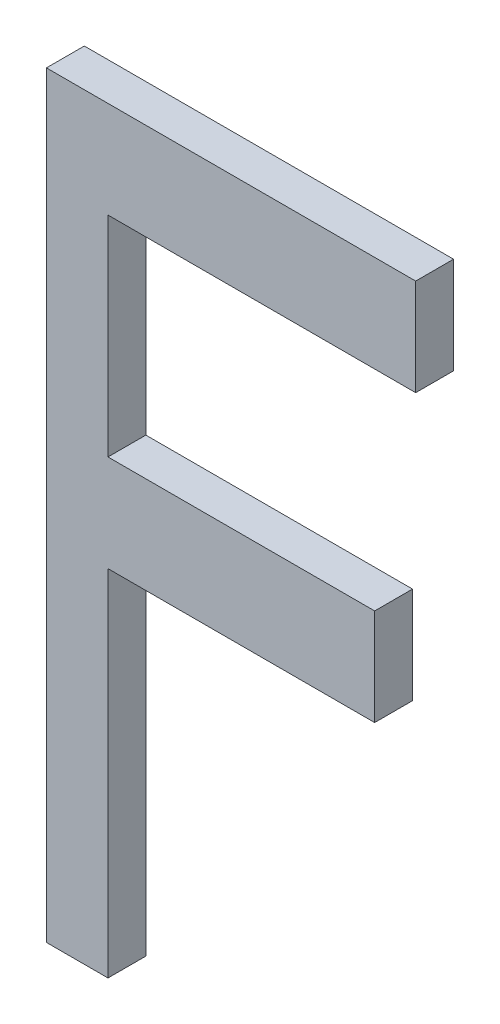
ISO-10303-21;
HEADER;
FILE_DESCRIPTION(('STEP AP214'),'2;1');
FILE_NAME('part.step','',(''),(''),'','','');
FILE_SCHEMA(('AUTOMOTIVE_DESIGN { 1 0 10303 214 1 1 1 1 }'));
ENDSEC;
DATA;
#1=APPLICATION_CONTEXT('core data for automotive mechanical design processes');
#2=APPLICATION_PROTOCOL_DEFINITION('international standard','automotive_design',2000,#1);
#3=PRODUCT_CONTEXT('',#1,'mechanical');
#4=PRODUCT('Part','Part','',(#3));
#5=PRODUCT_RELATED_PRODUCT_CATEGORY('part','',(#4));
#6=PRODUCT_DEFINITION_FORMATION('','',#4);
#7=PRODUCT_DEFINITION_CONTEXT('part definition',#1,'design');
#8=PRODUCT_DEFINITION('design','',#6,#7);
#9=PRODUCT_DEFINITION_SHAPE('','',#8);
#10=(LENGTH_UNIT() NAMED_UNIT(*) SI_UNIT(.MILLI.,.METRE.));
#11=(NAMED_UNIT(*) PLANE_ANGLE_UNIT() SI_UNIT($,.RADIAN.));
#12=(NAMED_UNIT(*) SI_UNIT($,.STERADIAN.) SOLID_ANGLE_UNIT());
#13=UNCERTAINTY_MEASURE_WITH_UNIT(LENGTH_MEASURE(1.E-05),#10,'distance_accuracy_value','');
#14=(GEOMETRIC_REPRESENTATION_CONTEXT(3) GLOBAL_UNCERTAINTY_ASSIGNED_CONTEXT((#13)) GLOBAL_UNIT_ASSIGNED_CONTEXT((#10,
#11,#12)) REPRESENTATION_CONTEXT('',''));
#15=CARTESIAN_POINT('',(0.,0.,0.));
#16=DIRECTION('',(0.,0.,1.));
#17=DIRECTION('',(1.,0.,0.));
#18=AXIS2_PLACEMENT_3D('',#15,#16,#17);
#19=CARTESIAN_POINT('',(32.6648311134674,28.2906710184784,5.9));
#20=DIRECTION('',(0.,0.,1.));
#21=DIRECTION('',(1.,0.,0.));
#22=AXIS2_PLACEMENT_3D('',#19,#20,#21);
#23=PLANE('',#22);
#24=DIRECTION('',(1.,0.,0.));
#25=VECTOR('',#24,1.);
#26=CARTESIAN_POINT('',(32.6648311134674,30.2906710184784,5.9));
#27=LINE('',#26,#25);
#28=CARTESIAN_POINT('',(33.6398311134674,30.2906710184784,5.9));
#29=VERTEX_POINT('',#28);
#30=CARTESIAN_POINT('',(32.6648311134674,30.2906710184784,5.9));
#31=VERTEX_POINT('',#30);
#32=EDGE_CURVE('E126',#29,#31,#27,.F.);
#33=ORIENTED_EDGE('',*,*,#32,.F.);
#34=DIRECTION('',(0.,1.,0.));
#35=VECTOR('',#34,1.);
#36=CARTESIAN_POINT('',(33.6398311134674,28.2906710184784,5.9));
#37=LINE('',#36,#35);
#38=CARTESIAN_POINT('',(33.6398311134674,30.0353518999784,5.9));
#39=VERTEX_POINT('',#38);
#40=EDGE_CURVE('E124',#39,#29,#37,.T.);
#41=ORIENTED_EDGE('',*,*,#40,.F.);
#42=DIRECTION('',(1.,0.,0.));
#43=VECTOR('',#42,1.);
#44=CARTESIAN_POINT('',(32.6648311134674,30.0353518999784,5.9));
#45=LINE('',#44,#43);
#46=CARTESIAN_POINT('',(32.8273311134674,30.0353518999784,5.9));
#47=VERTEX_POINT('',#46);
#48=EDGE_CURVE('E122',#47,#39,#45,.T.);
#49=ORIENTED_EDGE('',*,*,#48,.F.);
#50=DIRECTION('',(0.,1.,0.));
#51=VECTOR('',#50,1.);
#52=CARTESIAN_POINT('',(32.8273311134674,28.2906710184784,5.9));
#53=LINE('',#52,#51);
#54=CARTESIAN_POINT('',(32.8273311134674,29.4821603573584,5.9));
#55=VERTEX_POINT('',#54);
#56=EDGE_CURVE('E120',#55,#47,#53,.T.);
#57=ORIENTED_EDGE('',*,*,#56,.F.);
#58=DIRECTION('',(1.,0.,0.));
#59=VECTOR('',#58,1.);
#60=CARTESIAN_POINT('',(32.6648311134674,29.4821603573585,5.9));
#61=LINE('',#60,#59);
#62=CARTESIAN_POINT('',(33.5314978059574,29.4821603573585,5.9));
#63=VERTEX_POINT('',#62);
#64=EDGE_CURVE('E118',#63,#55,#61,.F.);
#65=ORIENTED_EDGE('',*,*,#64,.F.);
#66=DIRECTION('',(0.,1.,0.));
#67=VECTOR('',#66,1.);
#68=CARTESIAN_POINT('',(33.5314978059574,28.2906710184784,5.9));
#69=LINE('',#68,#67);
#70=CARTESIAN_POINT('',(33.5314978059574,29.2268412388584,5.9));
#71=VERTEX_POINT('',#70);
#72=EDGE_CURVE('E114',#71,#63,#69,.T.);
#73=ORIENTED_EDGE('',*,*,#72,.F.);
#74=DIRECTION('',(1.,0.,0.));
#75=VECTOR('',#74,1.);
#76=CARTESIAN_POINT('',(32.6648311134674,29.2268412388584,5.9));
#77=LINE('',#76,#75);
#78=CARTESIAN_POINT('',(32.8273311134674,29.2268412388584,5.9));
#79=VERTEX_POINT('',#78);
#80=EDGE_CURVE('E113',#79,#71,#77,.T.);
#81=ORIENTED_EDGE('',*,*,#80,.F.);
#82=DIRECTION('',(0.,1.,0.));
#83=VECTOR('',#82,1.);
#84=CARTESIAN_POINT('',(32.8273311134674,28.2906710184784,5.9));
#85=LINE('',#84,#83);
#86=CARTESIAN_POINT('',(32.8273311134674,28.2906710184784,5.9));
#87=VERTEX_POINT('',#86);
#88=EDGE_CURVE('E91',#87,#79,#85,.T.);
#89=ORIENTED_EDGE('',*,*,#88,.F.);
#90=DIRECTION('',(1.,0.,0.));
#91=VECTOR('',#90,1.);
#92=CARTESIAN_POINT('',(32.6648311134674,28.2906710184784,5.9));
#93=LINE('',#92,#91);
#94=CARTESIAN_POINT('',(32.6648311134674,28.2906710184784,5.9));
#95=VERTEX_POINT('',#94);
#96=EDGE_CURVE('E20',#95,#87,#93,.T.);
#97=ORIENTED_EDGE('',*,*,#96,.F.);
#98=DIRECTION('',(0.,1.,0.));
#99=VECTOR('',#98,1.);
#100=CARTESIAN_POINT('',(32.6648311134674,30.2906710184784,5.9));
#101=LINE('',#100,#99);
#102=EDGE_CURVE('E128',#95,#31,#101,.T.);
#103=ORIENTED_EDGE('',*,*,#102,.T.);
#104=EDGE_LOOP('',(#33,#41,#49,#57,#65,#73,#81,#89,#97,#103));
#105=FACE_BOUND('',#104,.T.);
#106=ADVANCED_FACE('F17',(#105),#23,.F.);
#107=CARTESIAN_POINT('',(32.6648311134674,30.2906710184784,6.));
#108=DIRECTION('',(1.,0.,0.));
#109=DIRECTION('',(0.,0.,-1.));
#110=AXIS2_PLACEMENT_3D('',#107,#108,#109);
#111=PLANE('',#110);
#112=DIRECTION('',(0.,0.,1.));
#113=VECTOR('',#112,1.);
#114=CARTESIAN_POINT('',(32.6648311134674,28.2906710184784,6.));
#115=LINE('',#114,#113);
#116=CARTESIAN_POINT('',(32.6648311134674,28.2906710184784,6.));
#117=VERTEX_POINT('',#116);
#118=EDGE_CURVE('E100',#95,#117,#115,.T.);
#119=ORIENTED_EDGE('',*,*,#118,.T.);
#120=DIRECTION('',(0.,1.,0.));
#121=VECTOR('',#120,1.);
#122=CARTESIAN_POINT('',(32.6648311134674,28.2906710184784,6.));
#123=LINE('',#122,#121);
#124=CARTESIAN_POINT('',(32.6648311134674,30.2906710184784,6.));
#125=VERTEX_POINT('',#124);
#126=EDGE_CURVE('E146',#125,#117,#123,.F.);
#127=ORIENTED_EDGE('',*,*,#126,.F.);
#128=DIRECTION('',(0.,0.,-1.));
#129=VECTOR('',#128,1.);
#130=CARTESIAN_POINT('',(32.6648311134674,30.2906710184784,6.));
#131=LINE('',#130,#129);
#132=EDGE_CURVE('E143',#125,#31,#131,.T.);
#133=ORIENTED_EDGE('',*,*,#132,.T.);
#134=ORIENTED_EDGE('',*,*,#102,.F.);
#135=EDGE_LOOP('',(#119,#127,#133,#134));
#136=FACE_BOUND('',#135,.T.);
#137=ADVANCED_FACE('F181',(#136),#111,.F.);
#138=CARTESIAN_POINT('',(32.6648311134674,28.2906710184784,6.));
#139=DIRECTION('',(0.,1.,0.));
#140=DIRECTION('',(0.,0.,1.));
#141=AXIS2_PLACEMENT_3D('',#138,#139,#140);
#142=PLANE('',#141);
#143=DIRECTION('',(0.,0.,1.));
#144=VECTOR('',#143,1.);
#145=CARTESIAN_POINT('',(32.8273311134674,28.2906710184784,6.));
#146=LINE('',#145,#144);
#147=CARTESIAN_POINT('',(32.8273311134674,28.2906710184784,6.));
#148=VERTEX_POINT('',#147);
#149=EDGE_CURVE('E98',#87,#148,#146,.T.);
#150=ORIENTED_EDGE('',*,*,#149,.T.);
#151=DIRECTION('',(1.,0.,0.));
#152=VECTOR('',#151,1.);
#153=CARTESIAN_POINT('',(32.6648311134674,28.2906710184784,6.));
#154=LINE('',#153,#152);
#155=EDGE_CURVE('E149',#117,#148,#154,.T.);
#156=ORIENTED_EDGE('',*,*,#155,.F.);
#157=ORIENTED_EDGE('',*,*,#118,.F.);
#158=ORIENTED_EDGE('',*,*,#96,.T.);
#159=EDGE_LOOP('',(#150,#156,#157,#158));
#160=FACE_BOUND('',#159,.T.);
#161=ADVANCED_FACE('F96',(#160),#142,.F.);
#162=CARTESIAN_POINT('',(32.8273311134674,28.2906710184784,6.));
#163=DIRECTION('',(-1.,0.,0.));
#164=DIRECTION('',(0.,0.,1.));
#165=AXIS2_PLACEMENT_3D('',#162,#163,#164);
#166=PLANE('',#165);
#167=DIRECTION('',(0.,0.,1.));
#168=VECTOR('',#167,1.);
#169=CARTESIAN_POINT('',(32.8273311134674,29.2268412388584,6.));
#170=LINE('',#169,#168);
#171=CARTESIAN_POINT('',(32.8273311134674,29.2268412388584,6.));
#172=VERTEX_POINT('',#171);
#173=EDGE_CURVE('E108',#79,#172,#170,.T.);
#174=ORIENTED_EDGE('',*,*,#173,.T.);
#175=DIRECTION('',(0.,1.,0.));
#176=VECTOR('',#175,1.);
#177=CARTESIAN_POINT('',(32.8273311134674,28.2906710184784,6.));
#178=LINE('',#177,#176);
#179=EDGE_CURVE('E106',#148,#172,#178,.T.);
#180=ORIENTED_EDGE('',*,*,#179,.F.);
#181=ORIENTED_EDGE('',*,*,#149,.F.);
#182=ORIENTED_EDGE('',*,*,#88,.T.);
#183=EDGE_LOOP('',(#174,#180,#181,#182));
#184=FACE_BOUND('',#183,.T.);
#185=ADVANCED_FACE('F104',(#184),#166,.F.);
#186=CARTESIAN_POINT('',(32.8273311134674,29.2268412388584,6.));
#187=DIRECTION('',(0.,1.,0.));
#188=DIRECTION('',(0.,0.,1.));
#189=AXIS2_PLACEMENT_3D('',#186,#187,#188);
#190=PLANE('',#189);
#191=DIRECTION('',(0.,0.,1.));
#192=VECTOR('',#191,1.);
#193=CARTESIAN_POINT('',(33.5314978059574,29.2268412388584,6.));
#194=LINE('',#193,#192);
#195=CARTESIAN_POINT('',(33.5314978059574,29.2268412388584,6.));
#196=VERTEX_POINT('',#195);
#197=EDGE_CURVE('E132',#71,#196,#194,.T.);
#198=ORIENTED_EDGE('',*,*,#197,.T.);
#199=DIRECTION('',(1.,0.,0.));
#200=VECTOR('',#199,1.);
#201=CARTESIAN_POINT('',(32.6648311134674,29.2268412388584,6.));
#202=LINE('',#201,#200);
#203=EDGE_CURVE('E152',#172,#196,#202,.T.);
#204=ORIENTED_EDGE('',*,*,#203,.F.);
#205=ORIENTED_EDGE('',*,*,#173,.F.);
#206=ORIENTED_EDGE('',*,*,#80,.T.);
#207=EDGE_LOOP('',(#198,#204,#205,#206));
#208=FACE_BOUND('',#207,.T.);
#209=ADVANCED_FACE('F185',(#208),#190,.F.);
#210=CARTESIAN_POINT('',(33.5314978059574,29.2268412388584,6.));
#211=DIRECTION('',(-1.,0.,0.));
#212=DIRECTION('',(0.,0.,1.));
#213=AXIS2_PLACEMENT_3D('',#210,#211,#212);
#214=PLANE('',#213);
#215=DIRECTION('',(0.,0.,-1.));
#216=VECTOR('',#215,1.);
#217=CARTESIAN_POINT('',(33.5314978059574,29.4821603573584,6.));
#218=LINE('',#217,#216);
#219=CARTESIAN_POINT('',(33.5314978059574,29.4821603573585,6.));
#220=VERTEX_POINT('',#219);
#221=EDGE_CURVE('E134',#63,#220,#218,.F.);
#222=ORIENTED_EDGE('',*,*,#221,.T.);
#223=DIRECTION('',(0.,1.,0.));
#224=VECTOR('',#223,1.);
#225=CARTESIAN_POINT('',(33.5314978059574,28.2906710184784,6.));
#226=LINE('',#225,#224);
#227=EDGE_CURVE('E155',#196,#220,#226,.T.);
#228=ORIENTED_EDGE('',*,*,#227,.F.);
#229=ORIENTED_EDGE('',*,*,#197,.F.);
#230=ORIENTED_EDGE('',*,*,#72,.T.);
#231=EDGE_LOOP('',(#222,#228,#229,#230));
#232=FACE_BOUND('',#231,.T.);
#233=ADVANCED_FACE('F188',(#232),#214,.F.);
#234=CARTESIAN_POINT('',(33.5314978059574,29.4821603573584,6.));
#235=DIRECTION('',(0.,-1.,0.));
#236=DIRECTION('',(0.,0.,-1.));
#237=AXIS2_PLACEMENT_3D('',#234,#235,#236);
#238=PLANE('',#237);
#239=DIRECTION('',(0.,0.,1.));
#240=VECTOR('',#239,1.);
#241=CARTESIAN_POINT('',(32.8273311134674,29.4821603573584,6.));
#242=LINE('',#241,#240);
#243=CARTESIAN_POINT('',(32.8273311134674,29.4821603573584,6.));
#244=VERTEX_POINT('',#243);
#245=EDGE_CURVE('E136',#55,#244,#242,.T.);
#246=ORIENTED_EDGE('',*,*,#245,.T.);
#247=DIRECTION('',(1.,0.,0.));
#248=VECTOR('',#247,1.);
#249=CARTESIAN_POINT('',(32.6648311134674,29.4821603573585,6.));
#250=LINE('',#249,#248);
#251=EDGE_CURVE('E158',#220,#244,#250,.F.);
#252=ORIENTED_EDGE('',*,*,#251,.F.);
#253=ORIENTED_EDGE('',*,*,#221,.F.);
#254=ORIENTED_EDGE('',*,*,#64,.T.);
#255=EDGE_LOOP('',(#246,#252,#253,#254));
#256=FACE_BOUND('',#255,.T.);
#257=ADVANCED_FACE('F193',(#256),#238,.F.);
#258=CARTESIAN_POINT('',(32.8273311134674,29.4821603573584,6.));
#259=DIRECTION('',(-1.,0.,0.));
#260=DIRECTION('',(0.,0.,1.));
#261=AXIS2_PLACEMENT_3D('',#258,#259,#260);
#262=PLANE('',#261);
#263=DIRECTION('',(0.,0.,1.));
#264=VECTOR('',#263,1.);
#265=CARTESIAN_POINT('',(32.8273311134674,30.0353518999784,6.));
#266=LINE('',#265,#264);
#267=CARTESIAN_POINT('',(32.8273311134674,30.0353518999784,6.));
#268=VERTEX_POINT('',#267);
#269=EDGE_CURVE('E138',#47,#268,#266,.T.);
#270=ORIENTED_EDGE('',*,*,#269,.T.);
#271=DIRECTION('',(0.,1.,0.));
#272=VECTOR('',#271,1.);
#273=CARTESIAN_POINT('',(32.8273311134674,28.2906710184784,6.));
#274=LINE('',#273,#272);
#275=EDGE_CURVE('E161',#244,#268,#274,.T.);
#276=ORIENTED_EDGE('',*,*,#275,.F.);
#277=ORIENTED_EDGE('',*,*,#245,.F.);
#278=ORIENTED_EDGE('',*,*,#56,.T.);
#279=EDGE_LOOP('',(#270,#276,#277,#278));
#280=FACE_BOUND('',#279,.T.);
#281=ADVANCED_FACE('F197',(#280),#262,.F.);
#282=CARTESIAN_POINT('',(32.8273311134674,30.0353518999784,6.));
#283=DIRECTION('',(0.,1.,0.));
#284=DIRECTION('',(0.,0.,1.));
#285=AXIS2_PLACEMENT_3D('',#282,#283,#284);
#286=PLANE('',#285);
#287=DIRECTION('',(0.,0.,1.));
#288=VECTOR('',#287,1.);
#289=CARTESIAN_POINT('',(33.6398311134674,30.0353518999784,6.));
#290=LINE('',#289,#288);
#291=CARTESIAN_POINT('',(33.6398311134674,30.0353518999784,6.));
#292=VERTEX_POINT('',#291);
#293=EDGE_CURVE('E140',#39,#292,#290,.T.);
#294=ORIENTED_EDGE('',*,*,#293,.T.);
#295=DIRECTION('',(1.,0.,0.));
#296=VECTOR('',#295,1.);
#297=CARTESIAN_POINT('',(32.6648311134674,30.0353518999784,6.));
#298=LINE('',#297,#296);
#299=EDGE_CURVE('E164',#268,#292,#298,.T.);
#300=ORIENTED_EDGE('',*,*,#299,.F.);
#301=ORIENTED_EDGE('',*,*,#269,.F.);
#302=ORIENTED_EDGE('',*,*,#48,.T.);
#303=EDGE_LOOP('',(#294,#300,#301,#302));
#304=FACE_BOUND('',#303,.T.);
#305=ADVANCED_FACE('F199',(#304),#286,.F.);
#306=CARTESIAN_POINT('',(33.6398311134674,30.0353518999784,6.));
#307=DIRECTION('',(-1.,0.,0.));
#308=DIRECTION('',(0.,0.,1.));
#309=AXIS2_PLACEMENT_3D('',#306,#307,#308);
#310=PLANE('',#309);
#311=DIRECTION('',(0.,0.,-1.));
#312=VECTOR('',#311,1.);
#313=CARTESIAN_POINT('',(33.6398311134674,30.2906710184784,6.));
#314=LINE('',#313,#312);
#315=CARTESIAN_POINT('',(33.6398311134674,30.2906710184784,6.));
#316=VERTEX_POINT('',#315);
#317=EDGE_CURVE('E35',#29,#316,#314,.F.);
#318=ORIENTED_EDGE('',*,*,#317,.T.);
#319=DIRECTION('',(0.,1.,0.));
#320=VECTOR('',#319,1.);
#321=CARTESIAN_POINT('',(33.6398311134674,28.2906710184784,6.));
#322=LINE('',#321,#320);
#323=EDGE_CURVE('E26',#292,#316,#322,.T.);
#324=ORIENTED_EDGE('',*,*,#323,.F.);
#325=ORIENTED_EDGE('',*,*,#293,.F.);
#326=ORIENTED_EDGE('',*,*,#40,.T.);
#327=EDGE_LOOP('',(#318,#324,#325,#326));
#328=FACE_BOUND('',#327,.T.);
#329=ADVANCED_FACE('F172',(#328),#310,.F.);
#330=CARTESIAN_POINT('',(33.6398311134674,30.2906710184784,6.));
#331=DIRECTION('',(0.,-1.,0.));
#332=DIRECTION('',(0.,0.,-1.));
#333=AXIS2_PLACEMENT_3D('',#330,#331,#332);
#334=PLANE('',#333);
#335=ORIENTED_EDGE('',*,*,#132,.F.);
#336=DIRECTION('',(1.,0.,0.));
#337=VECTOR('',#336,1.);
#338=CARTESIAN_POINT('',(32.6648311134674,30.2906710184784,6.));
#339=LINE('',#338,#337);
#340=EDGE_CURVE('E11',#316,#125,#339,.F.);
#341=ORIENTED_EDGE('',*,*,#340,.F.);
#342=ORIENTED_EDGE('',*,*,#317,.F.);
#343=ORIENTED_EDGE('',*,*,#32,.T.);
#344=EDGE_LOOP('',(#335,#341,#342,#343));
#345=FACE_BOUND('',#344,.T.);
#346=ADVANCED_FACE('F179',(#345),#334,.F.);
#347=CARTESIAN_POINT('',(32.6648311134674,28.2906710184784,6.));
#348=DIRECTION('',(0.,0.,1.));
#349=DIRECTION('',(1.,0.,0.));
#350=AXIS2_PLACEMENT_3D('',#347,#348,#349);
#351=PLANE('',#350);
#352=ORIENTED_EDGE('',*,*,#323,.T.);
#353=ORIENTED_EDGE('',*,*,#340,.T.);
#354=ORIENTED_EDGE('',*,*,#126,.T.);
#355=ORIENTED_EDGE('',*,*,#155,.T.);
#356=ORIENTED_EDGE('',*,*,#179,.T.);
#357=ORIENTED_EDGE('',*,*,#203,.T.);
#358=ORIENTED_EDGE('',*,*,#227,.T.);
#359=ORIENTED_EDGE('',*,*,#251,.T.);
#360=ORIENTED_EDGE('',*,*,#275,.T.);
#361=ORIENTED_EDGE('',*,*,#299,.T.);
#362=EDGE_LOOP('',(#352,#353,#354,#355,#356,#357,#358,#359,#360,#361));
#363=FACE_BOUND('',#362,.T.);
#364=ADVANCED_FACE('F169',(#363),#351,.T.);
#365=CLOSED_SHELL('',(#106,#137,#161,#185,#209,#233,#257,#281,#305,#329,#346,#364));
#366=MANIFOLD_SOLID_BREP('B1',#365);
#367=ADVANCED_BREP_SHAPE_REPRESENTATION('',(#18,#366),#14);
#368=SHAPE_DEFINITION_REPRESENTATION(#9,#367);
ENDSEC;
END-ISO-10303-21;
